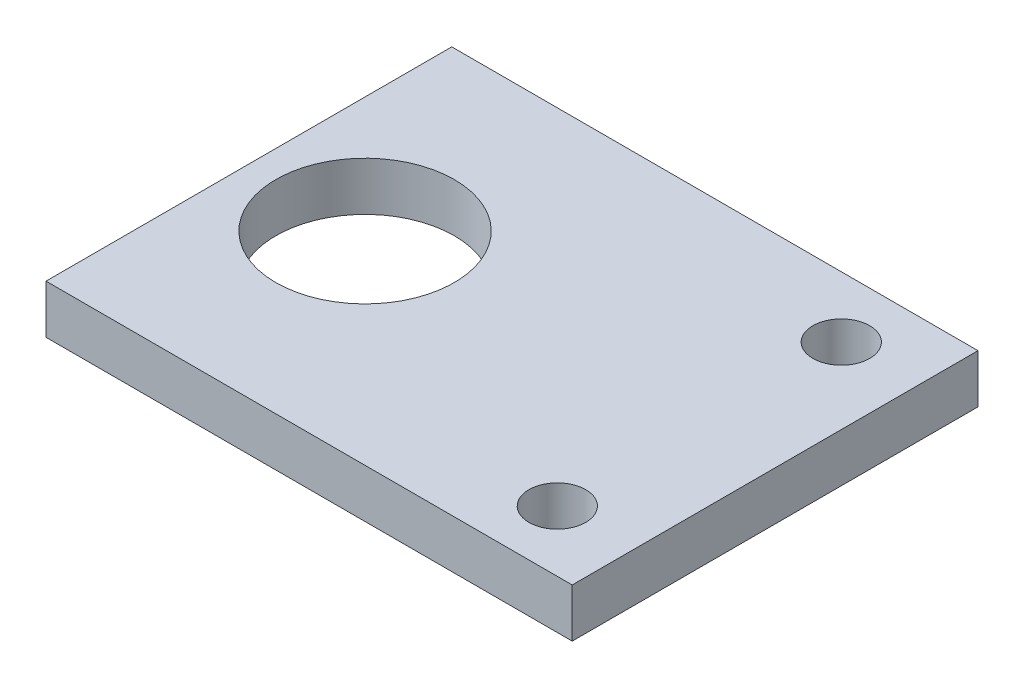
ISO-10303-21;
HEADER;
FILE_DESCRIPTION(('STEP AP214'),'2;1');
FILE_NAME('part.step','',(''),(''),'','','');
FILE_SCHEMA(('AUTOMOTIVE_DESIGN { 1 0 10303 214 1 1 1 1 }'));
ENDSEC;
DATA;
#1=APPLICATION_CONTEXT('core data for automotive mechanical design processes');
#2=APPLICATION_PROTOCOL_DEFINITION('international standard','automotive_design',2000,#1);
#3=PRODUCT_CONTEXT('',#1,'mechanical');
#4=PRODUCT('Part','Part','',(#3));
#5=PRODUCT_RELATED_PRODUCT_CATEGORY('part','',(#4));
#6=PRODUCT_DEFINITION_FORMATION('','',#4);
#7=PRODUCT_DEFINITION_CONTEXT('part definition',#1,'design');
#8=PRODUCT_DEFINITION('design','',#6,#7);
#9=PRODUCT_DEFINITION_SHAPE('','',#8);
#10=(LENGTH_UNIT() NAMED_UNIT(*) SI_UNIT(.MILLI.,.METRE.));
#11=(NAMED_UNIT(*) PLANE_ANGLE_UNIT() SI_UNIT($,.RADIAN.));
#12=(NAMED_UNIT(*) SI_UNIT($,.STERADIAN.) SOLID_ANGLE_UNIT());
#13=UNCERTAINTY_MEASURE_WITH_UNIT(LENGTH_MEASURE(1.E-05),#10,'distance_accuracy_value','');
#14=(GEOMETRIC_REPRESENTATION_CONTEXT(3) GLOBAL_UNCERTAINTY_ASSIGNED_CONTEXT((#13)) GLOBAL_UNIT_ASSIGNED_CONTEXT((#10,
#11,#12)) REPRESENTATION_CONTEXT('',''));
#15=CARTESIAN_POINT('',(0.,0.,0.));
#16=DIRECTION('',(0.,0.,1.));
#17=DIRECTION('',(1.,0.,0.));
#18=AXIS2_PLACEMENT_3D('',#15,#16,#17);
#19=CARTESIAN_POINT('',(0.,3.,-12.503883402303));
#20=DIRECTION('',(0.,0.,-1.));
#21=DIRECTION('',(-1.,0.,0.));
#22=AXIS2_PLACEMENT_3D('',#19,#20,#21);
#23=PLANE('',#22);
#24=DIRECTION('',(1.,0.,0.));
#25=VECTOR('',#24,1.);
#26=CARTESIAN_POINT('',(0.,0.,-12.503883402303));
#27=LINE('',#26,#25);
#28=CARTESIAN_POINT('',(-26.0804498825919,0.,-12.503883402303));
#29=VERTEX_POINT('',#28);
#30=CARTESIAN_POINT('',(6.34908675524667,0.,-12.503883402303));
#31=VERTEX_POINT('',#30);
#32=EDGE_CURVE('E123',#29,#31,#27,.T.);
#33=ORIENTED_EDGE('',*,*,#32,.F.);
#34=DIRECTION('',(0.,-1.,0.));
#35=VECTOR('',#34,1.);
#36=CARTESIAN_POINT('',(-26.0804498825919,3.,-12.503883402303));
#37=LINE('',#36,#35);
#38=CARTESIAN_POINT('',(-26.0804498825919,3.,-12.503883402303));
#39=VERTEX_POINT('',#38);
#40=EDGE_CURVE('E11',#39,#29,#37,.T.);
#41=ORIENTED_EDGE('',*,*,#40,.F.);
#42=DIRECTION('',(1.,0.,0.));
#43=VECTOR('',#42,1.);
#44=CARTESIAN_POINT('',(0.,3.,-12.503883402303));
#45=LINE('',#44,#43);
#46=CARTESIAN_POINT('',(6.34908675524667,3.,-12.503883402303));
#47=VERTEX_POINT('',#46);
#48=EDGE_CURVE('E102',#39,#47,#45,.T.);
#49=ORIENTED_EDGE('',*,*,#48,.T.);
#50=DIRECTION('',(0.,-1.,0.));
#51=VECTOR('',#50,1.);
#52=CARTESIAN_POINT('',(6.34908675524667,3.,-12.503883402303));
#53=LINE('',#52,#51);
#54=EDGE_CURVE('E80',#47,#31,#53,.T.);
#55=ORIENTED_EDGE('',*,*,#54,.T.);
#56=EDGE_LOOP('',(#33,#41,#49,#55));
#57=FACE_BOUND('',#56,.T.);
#58=ADVANCED_FACE('F41',(#57),#23,.T.);
#59=CARTESIAN_POINT('',(-26.0804498825919,3.,0.));
#60=DIRECTION('',(-1.,0.,0.));
#61=DIRECTION('',(0.,0.,1.));
#62=AXIS2_PLACEMENT_3D('',#59,#60,#61);
#63=PLANE('',#62);
#64=DIRECTION('',(0.,0.,-1.));
#65=VECTOR('',#64,1.);
#66=CARTESIAN_POINT('',(-26.0804498825919,0.,0.));
#67=LINE('',#66,#65);
#68=CARTESIAN_POINT('',(-26.0804498825919,0.,12.503883402303));
#69=VERTEX_POINT('',#68);
#70=EDGE_CURVE('E93',#69,#29,#67,.T.);
#71=ORIENTED_EDGE('',*,*,#70,.F.);
#72=DIRECTION('',(0.,-1.,0.));
#73=VECTOR('',#72,1.);
#74=CARTESIAN_POINT('',(-26.0804498825919,3.,12.503883402303));
#75=LINE('',#74,#73);
#76=CARTESIAN_POINT('',(-26.0804498825919,3.,12.503883402303));
#77=VERTEX_POINT('',#76);
#78=EDGE_CURVE('E50',#77,#69,#75,.T.);
#79=ORIENTED_EDGE('',*,*,#78,.F.);
#80=DIRECTION('',(0.,0.,-1.));
#81=VECTOR('',#80,1.);
#82=CARTESIAN_POINT('',(-26.0804498825919,3.,0.));
#83=LINE('',#82,#81);
#84=EDGE_CURVE('E91',#77,#39,#83,.T.);
#85=ORIENTED_EDGE('',*,*,#84,.T.);
#86=ORIENTED_EDGE('',*,*,#40,.T.);
#87=EDGE_LOOP('',(#71,#79,#85,#86));
#88=FACE_BOUND('',#87,.T.);
#89=ADVANCED_FACE('F89',(#88),#63,.T.);
#90=CARTESIAN_POINT('',(0.,3.,12.503883402303));
#91=DIRECTION('',(0.,0.,-1.));
#92=DIRECTION('',(-1.,0.,0.));
#93=AXIS2_PLACEMENT_3D('',#90,#91,#92);
#94=PLANE('',#93);
#95=DIRECTION('',(1.,0.,0.));
#96=VECTOR('',#95,1.);
#97=CARTESIAN_POINT('',(0.,0.,12.503883402303));
#98=LINE('',#97,#96);
#99=CARTESIAN_POINT('',(6.34908675524667,0.,12.503883402303));
#100=VERTEX_POINT('',#99);
#101=EDGE_CURVE('E73',#69,#100,#98,.T.);
#102=ORIENTED_EDGE('',*,*,#101,.T.);
#103=DIRECTION('',(0.,-1.,0.));
#104=VECTOR('',#103,1.);
#105=CARTESIAN_POINT('',(6.34908675524667,3.,12.503883402303));
#106=LINE('',#105,#104);
#107=CARTESIAN_POINT('',(6.34908675524667,3.,12.503883402303));
#108=VERTEX_POINT('',#107);
#109=EDGE_CURVE('E95',#108,#100,#106,.T.);
#110=ORIENTED_EDGE('',*,*,#109,.F.);
#111=DIRECTION('',(1.,0.,0.));
#112=VECTOR('',#111,1.);
#113=CARTESIAN_POINT('',(0.,3.,12.503883402303));
#114=LINE('',#113,#112);
#115=EDGE_CURVE('E96',#77,#108,#114,.T.);
#116=ORIENTED_EDGE('',*,*,#115,.F.);
#117=ORIENTED_EDGE('',*,*,#78,.T.);
#118=EDGE_LOOP('',(#102,#110,#116,#117));
#119=FACE_BOUND('',#118,.T.);
#120=ADVANCED_FACE('F97',(#119),#94,.F.);
#121=CARTESIAN_POINT('',(1.67803429162289,3.,8.75));
#122=DIRECTION('',(0.,-1.,0.));
#123=DIRECTION('',(0.,0.,-1.));
#124=AXIS2_PLACEMENT_3D('',#121,#122,#123);
#125=CYLINDRICAL_SURFACE('',#124,1.75);
#126=CARTESIAN_POINT('',(1.67803429162289,3.,8.75));
#127=DIRECTION('',(0.,1.,0.));
#128=DIRECTION('',(0.,0.,1.));
#129=AXIS2_PLACEMENT_3D('',#126,#127,#128);
#130=CIRCLE('',#129,1.75);
#131=CARTESIAN_POINT('',(1.67803429162289,3.,10.5));
#132=VERTEX_POINT('',#131);
#133=EDGE_CURVE('E115',#132,#132,#130,.F.);
#134=ORIENTED_EDGE('',*,*,#133,.F.);
#135=EDGE_LOOP('',(#134));
#136=FACE_BOUND('',#135,.T.);
#137=CARTESIAN_POINT('',(1.67803429162289,0.,8.75));
#138=DIRECTION('',(0.,1.,0.));
#139=DIRECTION('',(0.,0.,1.));
#140=AXIS2_PLACEMENT_3D('',#137,#138,#139);
#141=CIRCLE('',#140,1.75);
#142=CARTESIAN_POINT('',(1.67803429162289,0.,10.5));
#143=VERTEX_POINT('',#142);
#144=EDGE_CURVE('E138',#143,#143,#141,.F.);
#145=ORIENTED_EDGE('',*,*,#144,.T.);
#146=EDGE_LOOP('',(#145));
#147=FACE_BOUND('',#146,.T.);
#148=ADVANCED_FACE('F161',(#136,#147),#125,.F.);
#149=CARTESIAN_POINT('',(1.67803429162289,3.,-8.75));
#150=DIRECTION('',(0.,-1.,0.));
#151=DIRECTION('',(0.,0.,-1.));
#152=AXIS2_PLACEMENT_3D('',#149,#150,#151);
#153=CYLINDRICAL_SURFACE('',#152,1.75);
#154=CARTESIAN_POINT('',(1.67803429162289,3.,-8.75));
#155=DIRECTION('',(0.,1.,0.));
#156=DIRECTION('',(0.,0.,1.));
#157=AXIS2_PLACEMENT_3D('',#154,#155,#156);
#158=CIRCLE('',#157,1.75);
#159=CARTESIAN_POINT('',(1.67803429162289,3.,-7.));
#160=VERTEX_POINT('',#159);
#161=EDGE_CURVE('E111',#160,#160,#158,.T.);
#162=ORIENTED_EDGE('',*,*,#161,.T.);
#163=EDGE_LOOP('',(#162));
#164=FACE_BOUND('',#163,.T.);
#165=CARTESIAN_POINT('',(1.67803429162289,0.,-8.75));
#166=DIRECTION('',(0.,1.,0.));
#167=DIRECTION('',(0.,0.,1.));
#168=AXIS2_PLACEMENT_3D('',#165,#166,#167);
#169=CIRCLE('',#168,1.75);
#170=CARTESIAN_POINT('',(1.67803429162289,0.,-7.));
#171=VERTEX_POINT('',#170);
#172=EDGE_CURVE('E134',#171,#171,#169,.T.);
#173=ORIENTED_EDGE('',*,*,#172,.F.);
#174=EDGE_LOOP('',(#173));
#175=FACE_BOUND('',#174,.T.);
#176=ADVANCED_FACE('F167',(#164,#175),#153,.F.);
#177=CARTESIAN_POINT('',(6.34908675524668,3.,0.));
#178=DIRECTION('',(-1.,0.,0.));
#179=DIRECTION('',(0.,0.,1.));
#180=AXIS2_PLACEMENT_3D('',#177,#178,#179);
#181=PLANE('',#180);
#182=DIRECTION('',(0.,0.,-1.));
#183=VECTOR('',#182,1.);
#184=CARTESIAN_POINT('',(6.34908675524668,0.,0.));
#185=LINE('',#184,#183);
#186=EDGE_CURVE('E131',#100,#31,#185,.T.);
#187=ORIENTED_EDGE('',*,*,#186,.T.);
#188=ORIENTED_EDGE('',*,*,#54,.F.);
#189=DIRECTION('',(0.,0.,-1.));
#190=VECTOR('',#189,1.);
#191=CARTESIAN_POINT('',(6.34908675524668,3.,0.));
#192=LINE('',#191,#190);
#193=EDGE_CURVE('E58',#108,#47,#192,.T.);
#194=ORIENTED_EDGE('',*,*,#193,.F.);
#195=ORIENTED_EDGE('',*,*,#109,.T.);
#196=EDGE_LOOP('',(#187,#188,#194,#195));
#197=FACE_BOUND('',#196,.T.);
#198=ADVANCED_FACE('F150',(#197),#181,.F.);
#199=CARTESIAN_POINT('',(-18.9219657083771,3.,0.));
#200=DIRECTION('',(0.,-1.,0.));
#201=DIRECTION('',(0.,0.,-1.));
#202=AXIS2_PLACEMENT_3D('',#199,#200,#201);
#203=CYLINDRICAL_SURFACE('',#202,5.5);
#204=CARTESIAN_POINT('',(-18.9219657083771,3.,0.));
#205=DIRECTION('',(0.,1.,0.));
#206=DIRECTION('',(0.,0.,1.));
#207=AXIS2_PLACEMENT_3D('',#204,#205,#206);
#208=CIRCLE('',#207,5.5);
#209=CARTESIAN_POINT('',(-18.9219657083771,3.,5.5));
#210=VERTEX_POINT('',#209);
#211=EDGE_CURVE('E119',#210,#210,#208,.T.);
#212=ORIENTED_EDGE('',*,*,#211,.T.);
#213=EDGE_LOOP('',(#212));
#214=FACE_BOUND('',#213,.T.);
#215=CARTESIAN_POINT('',(-18.9219657083771,0.,0.));
#216=DIRECTION('',(0.,1.,0.));
#217=DIRECTION('',(0.,0.,1.));
#218=AXIS2_PLACEMENT_3D('',#215,#216,#217);
#219=CIRCLE('',#218,5.5);
#220=CARTESIAN_POINT('',(-18.9219657083771,0.,5.5));
#221=VERTEX_POINT('',#220);
#222=EDGE_CURVE('E106',#221,#221,#219,.T.);
#223=ORIENTED_EDGE('',*,*,#222,.F.);
#224=EDGE_LOOP('',(#223));
#225=FACE_BOUND('',#224,.T.);
#226=ADVANCED_FACE('F166',(#214,#225),#203,.F.);
#227=CARTESIAN_POINT('',(0.,3.,0.));
#228=DIRECTION('',(0.,1.,0.));
#229=DIRECTION('',(0.,0.,1.));
#230=AXIS2_PLACEMENT_3D('',#227,#228,#229);
#231=PLANE('',#230);
#232=ORIENTED_EDGE('',*,*,#48,.F.);
#233=ORIENTED_EDGE('',*,*,#84,.F.);
#234=ORIENTED_EDGE('',*,*,#115,.T.);
#235=ORIENTED_EDGE('',*,*,#193,.T.);
#236=EDGE_LOOP('',(#232,#233,#234,#235));
#237=FACE_BOUND('',#236,.T.);
#238=ORIENTED_EDGE('',*,*,#161,.F.);
#239=EDGE_LOOP('',(#238));
#240=FACE_BOUND('',#239,.T.);
#241=ORIENTED_EDGE('',*,*,#133,.T.);
#242=EDGE_LOOP('',(#241));
#243=FACE_BOUND('',#242,.T.);
#244=ORIENTED_EDGE('',*,*,#211,.F.);
#245=EDGE_LOOP('',(#244));
#246=FACE_BOUND('',#245,.T.);
#247=ADVANCED_FACE('F100',(#237,#240,#243,#246),#231,.T.);
#248=CARTESIAN_POINT('',(0.,0.,0.));
#249=DIRECTION('',(0.,1.,0.));
#250=DIRECTION('',(0.,0.,1.));
#251=AXIS2_PLACEMENT_3D('',#248,#249,#250);
#252=PLANE('',#251);
#253=ORIENTED_EDGE('',*,*,#32,.T.);
#254=ORIENTED_EDGE('',*,*,#186,.F.);
#255=ORIENTED_EDGE('',*,*,#101,.F.);
#256=ORIENTED_EDGE('',*,*,#70,.T.);
#257=EDGE_LOOP('',(#253,#254,#255,#256));
#258=FACE_BOUND('',#257,.T.);
#259=ORIENTED_EDGE('',*,*,#172,.T.);
#260=EDGE_LOOP('',(#259));
#261=FACE_BOUND('',#260,.T.);
#262=ORIENTED_EDGE('',*,*,#144,.F.);
#263=EDGE_LOOP('',(#262));
#264=FACE_BOUND('',#263,.T.);
#265=ORIENTED_EDGE('',*,*,#222,.T.);
#266=EDGE_LOOP('',(#265));
#267=FACE_BOUND('',#266,.T.);
#268=ADVANCED_FACE('F152',(#258,#261,#264,#267),#252,.F.);
#269=CLOSED_SHELL('',(#58,#89,#120,#148,#176,#198,#226,#247,#268));
#270=MANIFOLD_SOLID_BREP('B2',#269);
#271=ADVANCED_BREP_SHAPE_REPRESENTATION('',(#18,#270),#14);
#272=SHAPE_DEFINITION_REPRESENTATION(#9,#271);
ENDSEC;
END-ISO-10303-21;
